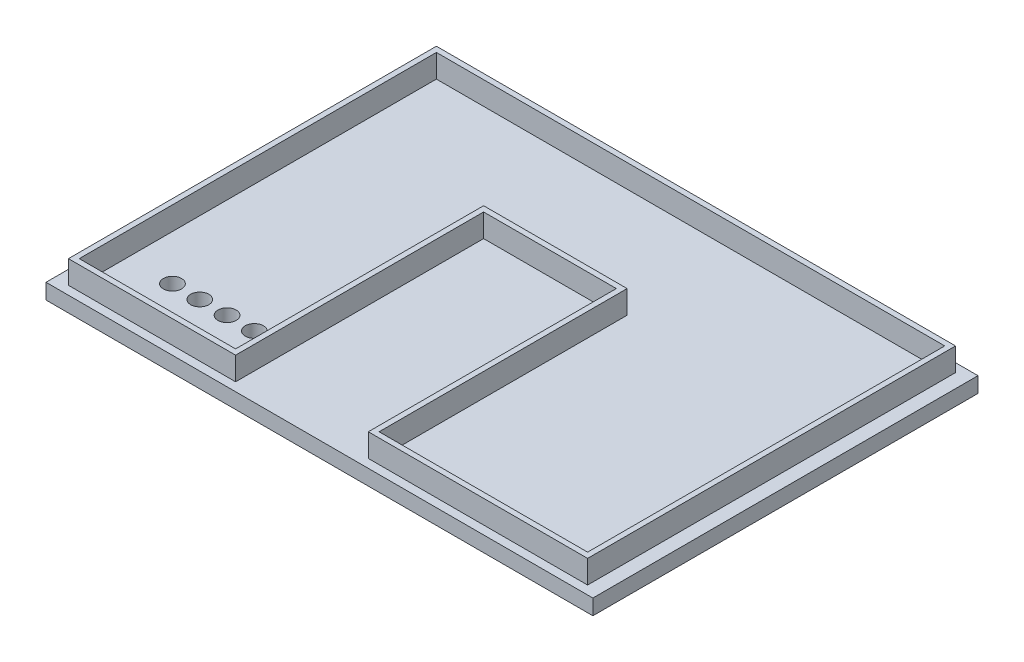
ISO-10303-21;
HEADER;
FILE_DESCRIPTION(('STEP AP214'),'2;1');
FILE_NAME('part.step','',(''),(''),'','','');
FILE_SCHEMA(('AUTOMOTIVE_DESIGN { 1 0 10303 214 1 1 1 1 }'));
ENDSEC;
DATA;
#1=APPLICATION_CONTEXT('core data for automotive mechanical design processes');
#2=APPLICATION_PROTOCOL_DEFINITION('international standard','automotive_design',2000,#1);
#3=PRODUCT_CONTEXT('',#1,'mechanical');
#4=PRODUCT('Part','Part','',(#3));
#5=PRODUCT_RELATED_PRODUCT_CATEGORY('part','',(#4));
#6=PRODUCT_DEFINITION_FORMATION('','',#4);
#7=PRODUCT_DEFINITION_CONTEXT('part definition',#1,'design');
#8=PRODUCT_DEFINITION('design','',#6,#7);
#9=PRODUCT_DEFINITION_SHAPE('','',#8);
#10=(LENGTH_UNIT() NAMED_UNIT(*) SI_UNIT(.MILLI.,.METRE.));
#11=(NAMED_UNIT(*) PLANE_ANGLE_UNIT() SI_UNIT($,.RADIAN.));
#12=(NAMED_UNIT(*) SI_UNIT($,.STERADIAN.) SOLID_ANGLE_UNIT());
#13=UNCERTAINTY_MEASURE_WITH_UNIT(LENGTH_MEASURE(1.E-05),#10,'distance_accuracy_value','');
#14=(GEOMETRIC_REPRESENTATION_CONTEXT(3) GLOBAL_UNCERTAINTY_ASSIGNED_CONTEXT((#13)) GLOBAL_UNIT_ASSIGNED_CONTEXT((#10,
#11,#12)) REPRESENTATION_CONTEXT('',''));
#15=CARTESIAN_POINT('',(0.,0.,0.));
#16=DIRECTION('',(0.,0.,1.));
#17=DIRECTION('',(1.,0.,0.));
#18=AXIS2_PLACEMENT_3D('',#15,#16,#17);
#19=CARTESIAN_POINT('',(0.,5.08,0.));
#20=DIRECTION('',(0.,1.,0.));
#21=DIRECTION('',(0.,0.,1.));
#22=AXIS2_PLACEMENT_3D('',#19,#20,#21);
#23=PLANE('',#22);
#24=DIRECTION('',(1.,0.,0.));
#25=VECTOR('',#24,1.);
#26=CARTESIAN_POINT('',(0.,5.08,0.));
#27=LINE('',#26,#25);
#28=CARTESIAN_POINT('',(0.,5.08,0.));
#29=VERTEX_POINT('',#28);
#30=CARTESIAN_POINT('',(180.34,5.08,0.));
#31=VERTEX_POINT('',#30);
#32=EDGE_CURVE('E353',#29,#31,#27,.T.);
#33=ORIENTED_EDGE('',*,*,#32,.T.);
#34=DIRECTION('',(0.,0.,-1.));
#35=VECTOR('',#34,1.);
#36=CARTESIAN_POINT('',(180.34,5.08,0.));
#37=LINE('',#36,#35);
#38=CARTESIAN_POINT('',(180.34,5.08,-127.));
#39=VERTEX_POINT('',#38);
#40=EDGE_CURVE('E356',#31,#39,#37,.T.);
#41=ORIENTED_EDGE('',*,*,#40,.T.);
#42=DIRECTION('',(1.,0.,0.));
#43=VECTOR('',#42,1.);
#44=CARTESIAN_POINT('',(0.,5.08,-127.));
#45=LINE('',#44,#43);
#46=CARTESIAN_POINT('',(0.,5.08,-127.));
#47=VERTEX_POINT('',#46);
#48=EDGE_CURVE('E359',#47,#39,#45,.T.);
#49=ORIENTED_EDGE('',*,*,#48,.F.);
#50=DIRECTION('',(0.,0.,-1.));
#51=VECTOR('',#50,1.);
#52=CARTESIAN_POINT('',(0.,5.08,0.));
#53=LINE('',#52,#51);
#54=EDGE_CURVE('E362',#29,#47,#53,.T.);
#55=ORIENTED_EDGE('',*,*,#54,.F.);
#56=EDGE_LOOP('',(#33,#41,#49,#55));
#57=FACE_BOUND('',#56,.T.);
#58=DIRECTION('',(-1.,0.,0.));
#59=VECTOR('',#58,1.);
#60=CARTESIAN_POINT('',(59.69,5.08,-2.8321));
#61=LINE('',#60,#59);
#62=CARTESIAN_POINT('',(59.69,5.08,-2.8321));
#63=VERTEX_POINT('',#62);
#64=CARTESIAN_POINT('',(4.57199999999998,5.08,-2.8321));
#65=VERTEX_POINT('',#64);
#66=EDGE_CURVE('E98',#63,#65,#61,.T.);
#67=ORIENTED_EDGE('',*,*,#66,.T.);
#68=DIRECTION('',(0.,0.,1.));
#69=VECTOR('',#68,1.);
#70=CARTESIAN_POINT('',(4.57199999999998,5.08,-124.1679));
#71=LINE('',#70,#69);
#72=CARTESIAN_POINT('',(4.57199999999998,5.08,-124.1679));
#73=VERTEX_POINT('',#72);
#74=EDGE_CURVE('E239',#73,#65,#71,.T.);
#75=ORIENTED_EDGE('',*,*,#74,.F.);
#76=DIRECTION('',(1.,0.,0.));
#77=VECTOR('',#76,1.);
#78=CARTESIAN_POINT('',(4.57199999999998,5.08,-124.1679));
#79=LINE('',#78,#77);
#80=CARTESIAN_POINT('',(175.768,5.08,-124.1679));
#81=VERTEX_POINT('',#80);
#82=EDGE_CURVE('E296',#73,#81,#79,.T.);
#83=ORIENTED_EDGE('',*,*,#82,.T.);
#84=DIRECTION('',(0.,0.,1.));
#85=VECTOR('',#84,1.);
#86=CARTESIAN_POINT('',(175.768,5.08,-124.1679));
#87=LINE('',#86,#85);
#88=CARTESIAN_POINT('',(175.768,5.08,-2.83210000000002));
#89=VERTEX_POINT('',#88);
#90=EDGE_CURVE('E328',#81,#89,#87,.T.);
#91=ORIENTED_EDGE('',*,*,#90,.T.);
#92=DIRECTION('',(1.,0.,0.));
#93=VECTOR('',#92,1.);
#94=CARTESIAN_POINT('',(103.4542,5.08,-2.83210000000002));
#95=LINE('',#94,#93);
#96=CARTESIAN_POINT('',(103.4542,5.08,-2.83210000000002));
#97=VERTEX_POINT('',#96);
#98=EDGE_CURVE('E325',#97,#89,#95,.T.);
#99=ORIENTED_EDGE('',*,*,#98,.F.);
#100=DIRECTION('',(0.,0.,1.));
#101=VECTOR('',#100,1.);
#102=CARTESIAN_POINT('',(103.4542,5.08,-84.6201));
#103=LINE('',#102,#101);
#104=CARTESIAN_POINT('',(103.4542,5.08,-84.6201));
#105=VERTEX_POINT('',#104);
#106=EDGE_CURVE('E322',#105,#97,#103,.T.);
#107=ORIENTED_EDGE('',*,*,#106,.F.);
#108=DIRECTION('',(1.,0.,0.));
#109=VECTOR('',#108,1.);
#110=CARTESIAN_POINT('',(59.69,5.08,-84.6201));
#111=LINE('',#110,#109);
#112=CARTESIAN_POINT('',(59.69,5.08,-84.6201));
#113=VERTEX_POINT('',#112);
#114=EDGE_CURVE('E319',#113,#105,#111,.T.);
#115=ORIENTED_EDGE('',*,*,#114,.F.);
#116=DIRECTION('',(0.,0.,1.));
#117=VECTOR('',#116,1.);
#118=CARTESIAN_POINT('',(59.69,5.08,-84.6201));
#119=LINE('',#118,#117);
#120=EDGE_CURVE('E103',#113,#63,#119,.T.);
#121=ORIENTED_EDGE('',*,*,#120,.T.);
#122=EDGE_LOOP('',(#67,#75,#83,#91,#99,#107,#115,#121));
#123=FACE_BOUND('',#122,.T.);
#124=ADVANCED_FACE('F81',(#57,#123),#23,.T.);
#125=CARTESIAN_POINT('',(0.,5.08,0.));
#126=DIRECTION('',(0.,0.,-1.));
#127=DIRECTION('',(-1.,0.,0.));
#128=AXIS2_PLACEMENT_3D('',#125,#126,#127);
#129=PLANE('',#128);
#130=DIRECTION('',(1.,0.,0.));
#131=VECTOR('',#130,1.);
#132=CARTESIAN_POINT('',(0.,0.,0.));
#133=LINE('',#132,#131);
#134=CARTESIAN_POINT('',(0.,0.,0.));
#135=VERTEX_POINT('',#134);
#136=CARTESIAN_POINT('',(180.34,0.,0.));
#137=VERTEX_POINT('',#136);
#138=EDGE_CURVE('E352',#135,#137,#133,.T.);
#139=ORIENTED_EDGE('',*,*,#138,.T.);
#140=DIRECTION('',(0.,-1.,0.));
#141=VECTOR('',#140,1.);
#142=CARTESIAN_POINT('',(180.34,5.08,0.));
#143=LINE('',#142,#141);
#144=EDGE_CURVE('E12',#31,#137,#143,.T.);
#145=ORIENTED_EDGE('',*,*,#144,.F.);
#146=ORIENTED_EDGE('',*,*,#32,.F.);
#147=DIRECTION('',(0.,-1.,0.));
#148=VECTOR('',#147,1.);
#149=CARTESIAN_POINT('',(0.,5.08,0.));
#150=LINE('',#149,#148);
#151=EDGE_CURVE('E365',#29,#135,#150,.T.);
#152=ORIENTED_EDGE('',*,*,#151,.T.);
#153=EDGE_LOOP('',(#139,#145,#146,#152));
#154=FACE_BOUND('',#153,.T.);
#155=ADVANCED_FACE('F83',(#154),#129,.F.);
#156=CARTESIAN_POINT('',(180.34,5.08,0.));
#157=DIRECTION('',(-1.,0.,0.));
#158=DIRECTION('',(0.,0.,1.));
#159=AXIS2_PLACEMENT_3D('',#156,#157,#158);
#160=PLANE('',#159);
#161=DIRECTION('',(0.,0.,-1.));
#162=VECTOR('',#161,1.);
#163=CARTESIAN_POINT('',(180.34,0.,0.));
#164=LINE('',#163,#162);
#165=CARTESIAN_POINT('',(180.34,0.,-127.));
#166=VERTEX_POINT('',#165);
#167=EDGE_CURVE('E368',#137,#166,#164,.T.);
#168=ORIENTED_EDGE('',*,*,#167,.T.);
#169=DIRECTION('',(0.,-1.,0.));
#170=VECTOR('',#169,1.);
#171=CARTESIAN_POINT('',(180.34,5.08,-127.));
#172=LINE('',#171,#170);
#173=EDGE_CURVE('E90',#39,#166,#172,.T.);
#174=ORIENTED_EDGE('',*,*,#173,.F.);
#175=ORIENTED_EDGE('',*,*,#40,.F.);
#176=ORIENTED_EDGE('',*,*,#144,.T.);
#177=EDGE_LOOP('',(#168,#174,#175,#176));
#178=FACE_BOUND('',#177,.T.);
#179=ADVANCED_FACE('F431',(#178),#160,.F.);
#180=CARTESIAN_POINT('',(0.,5.08,-127.));
#181=DIRECTION('',(0.,0.,-1.));
#182=DIRECTION('',(-1.,0.,0.));
#183=AXIS2_PLACEMENT_3D('',#180,#181,#182);
#184=PLANE('',#183);
#185=DIRECTION('',(1.,0.,0.));
#186=VECTOR('',#185,1.);
#187=CARTESIAN_POINT('',(0.,0.,-127.));
#188=LINE('',#187,#186);
#189=CARTESIAN_POINT('',(0.,0.,-127.));
#190=VERTEX_POINT('',#189);
#191=EDGE_CURVE('E371',#190,#166,#188,.T.);
#192=ORIENTED_EDGE('',*,*,#191,.F.);
#193=DIRECTION('',(0.,-1.,0.));
#194=VECTOR('',#193,1.);
#195=CARTESIAN_POINT('',(0.,5.08,-127.));
#196=LINE('',#195,#194);
#197=EDGE_CURVE('E377',#47,#190,#196,.T.);
#198=ORIENTED_EDGE('',*,*,#197,.F.);
#199=ORIENTED_EDGE('',*,*,#48,.T.);
#200=ORIENTED_EDGE('',*,*,#173,.T.);
#201=EDGE_LOOP('',(#192,#198,#199,#200));
#202=FACE_BOUND('',#201,.T.);
#203=ADVANCED_FACE('F428',(#202),#184,.T.);
#204=CARTESIAN_POINT('',(0.,5.08,0.));
#205=DIRECTION('',(-1.,0.,0.));
#206=DIRECTION('',(0.,0.,1.));
#207=AXIS2_PLACEMENT_3D('',#204,#205,#206);
#208=PLANE('',#207);
#209=DIRECTION('',(0.,0.,-1.));
#210=VECTOR('',#209,1.);
#211=CARTESIAN_POINT('',(0.,0.,0.));
#212=LINE('',#211,#210);
#213=EDGE_CURVE('E357',#135,#190,#212,.T.);
#214=ORIENTED_EDGE('',*,*,#213,.F.);
#215=ORIENTED_EDGE('',*,*,#151,.F.);
#216=ORIENTED_EDGE('',*,*,#54,.T.);
#217=ORIENTED_EDGE('',*,*,#197,.T.);
#218=EDGE_LOOP('',(#214,#215,#216,#217));
#219=FACE_BOUND('',#218,.T.);
#220=ADVANCED_FACE('F411',(#219),#208,.T.);
#221=CARTESIAN_POINT('',(0.,0.,0.));
#222=DIRECTION('',(0.,1.,0.));
#223=DIRECTION('',(0.,0.,1.));
#224=AXIS2_PLACEMENT_3D('',#221,#222,#223);
#225=PLANE('',#224);
#226=CARTESIAN_POINT('',(30.26,0.,-20.4409059762369));
#227=DIRECTION('',(0.,-1.,0.));
#228=DIRECTION('',(0.,0.,-1.));
#229=AXIS2_PLACEMENT_3D('',#226,#227,#228);
#230=CIRCLE('',#229,3.);
#231=CARTESIAN_POINT('',(30.26,0.,-23.4409059762369));
#232=VERTEX_POINT('',#231);
#233=EDGE_CURVE('E386',#232,#232,#230,.T.);
#234=ORIENTED_EDGE('',*,*,#233,.F.);
#235=EDGE_LOOP('',(#234));
#236=FACE_BOUND('',#235,.T.);
#237=CARTESIAN_POINT('',(39.26,0.,-20.4409059762369));
#238=DIRECTION('',(0.,-1.,0.));
#239=DIRECTION('',(0.,0.,-1.));
#240=AXIS2_PLACEMENT_3D('',#237,#238,#239);
#241=CIRCLE('',#240,3.);
#242=CARTESIAN_POINT('',(39.26,0.,-23.4409059762369));
#243=VERTEX_POINT('',#242);
#244=EDGE_CURVE('E400',#243,#243,#241,.T.);
#245=ORIENTED_EDGE('',*,*,#244,.F.);
#246=EDGE_LOOP('',(#245));
#247=FACE_BOUND('',#246,.T.);
#248=CARTESIAN_POINT('',(48.26,0.,-20.4409059762369));
#249=DIRECTION('',(0.,-1.,0.));
#250=DIRECTION('',(0.,0.,-1.));
#251=AXIS2_PLACEMENT_3D('',#248,#249,#250);
#252=CIRCLE('',#251,3.);
#253=CARTESIAN_POINT('',(48.26,0.,-23.4409059762369));
#254=VERTEX_POINT('',#253);
#255=EDGE_CURVE('E397',#254,#254,#252,.T.);
#256=ORIENTED_EDGE('',*,*,#255,.F.);
#257=EDGE_LOOP('',(#256));
#258=FACE_BOUND('',#257,.T.);
#259=CARTESIAN_POINT('',(21.26,0.,-20.4409059762369));
#260=DIRECTION('',(0.,-1.,0.));
#261=DIRECTION('',(0.,0.,-1.));
#262=AXIS2_PLACEMENT_3D('',#259,#260,#261);
#263=CIRCLE('',#262,3.);
#264=CARTESIAN_POINT('',(21.26,0.,-23.4409059762369));
#265=VERTEX_POINT('',#264);
#266=EDGE_CURVE('E382',#265,#265,#263,.T.);
#267=ORIENTED_EDGE('',*,*,#266,.F.);
#268=EDGE_LOOP('',(#267));
#269=FACE_BOUND('',#268,.T.);
#270=ORIENTED_EDGE('',*,*,#138,.F.);
#271=ORIENTED_EDGE('',*,*,#213,.T.);
#272=ORIENTED_EDGE('',*,*,#191,.T.);
#273=ORIENTED_EDGE('',*,*,#167,.F.);
#274=EDGE_LOOP('',(#270,#271,#272,#273));
#275=FACE_BOUND('',#274,.T.);
#276=ADVANCED_FACE('F408',(#236,#247,#258,#269,#275),#225,.F.);
#277=CARTESIAN_POINT('',(0.,12.7,0.));
#278=DIRECTION('',(0.,-1.,0.));
#279=DIRECTION('',(0.,0.,-1.));
#280=AXIS2_PLACEMENT_3D('',#277,#278,#279);
#281=PLANE('',#280);
#282=DIRECTION('',(0.,0.,1.));
#283=VECTOR('',#282,1.);
#284=CARTESIAN_POINT('',(4.57199999999998,12.7,-124.1679));
#285=LINE('',#284,#283);
#286=CARTESIAN_POINT('',(4.57199999999998,12.7,-124.1679));
#287=VERTEX_POINT('',#286);
#288=CARTESIAN_POINT('',(4.57199999999998,12.7,-2.8321));
#289=VERTEX_POINT('',#288);
#290=EDGE_CURVE('E293',#287,#289,#285,.T.);
#291=ORIENTED_EDGE('',*,*,#290,.T.);
#292=DIRECTION('',(-1.,0.,0.));
#293=VECTOR('',#292,1.);
#294=CARTESIAN_POINT('',(59.69,12.7,-2.8321));
#295=LINE('',#294,#293);
#296=CARTESIAN_POINT('',(59.69,12.7,-2.8321));
#297=VERTEX_POINT('',#296);
#298=EDGE_CURVE('E295',#297,#289,#295,.T.);
#299=ORIENTED_EDGE('',*,*,#298,.F.);
#300=DIRECTION('',(0.,0.,1.));
#301=VECTOR('',#300,1.);
#302=CARTESIAN_POINT('',(59.69,12.7,-84.6201));
#303=LINE('',#302,#301);
#304=CARTESIAN_POINT('',(59.69,12.7,-84.6201));
#305=VERTEX_POINT('',#304);
#306=EDGE_CURVE('E299',#305,#297,#303,.T.);
#307=ORIENTED_EDGE('',*,*,#306,.F.);
#308=DIRECTION('',(1.,0.,0.));
#309=VECTOR('',#308,1.);
#310=CARTESIAN_POINT('',(59.69,12.7,-84.6201));
#311=LINE('',#310,#309);
#312=CARTESIAN_POINT('',(103.4542,12.7,-84.6201));
#313=VERTEX_POINT('',#312);
#314=EDGE_CURVE('E302',#305,#313,#311,.T.);
#315=ORIENTED_EDGE('',*,*,#314,.T.);
#316=DIRECTION('',(0.,0.,1.));
#317=VECTOR('',#316,1.);
#318=CARTESIAN_POINT('',(103.4542,12.7,-84.6201));
#319=LINE('',#318,#317);
#320=CARTESIAN_POINT('',(103.4542,12.7,-2.83210000000002));
#321=VERTEX_POINT('',#320);
#322=EDGE_CURVE('E304',#313,#321,#319,.T.);
#323=ORIENTED_EDGE('',*,*,#322,.T.);
#324=DIRECTION('',(1.,0.,0.));
#325=VECTOR('',#324,1.);
#326=CARTESIAN_POINT('',(103.4542,12.7,-2.83210000000002));
#327=LINE('',#326,#325);
#328=CARTESIAN_POINT('',(175.768,12.7,-2.83210000000002));
#329=VERTEX_POINT('',#328);
#330=EDGE_CURVE('E306',#321,#329,#327,.T.);
#331=ORIENTED_EDGE('',*,*,#330,.T.);
#332=DIRECTION('',(0.,0.,1.));
#333=VECTOR('',#332,1.);
#334=CARTESIAN_POINT('',(175.768,12.7,-124.1679));
#335=LINE('',#334,#333);
#336=CARTESIAN_POINT('',(175.768,12.7,-124.1679));
#337=VERTEX_POINT('',#336);
#338=EDGE_CURVE('E308',#337,#329,#335,.T.);
#339=ORIENTED_EDGE('',*,*,#338,.F.);
#340=DIRECTION('',(1.,0.,0.));
#341=VECTOR('',#340,1.);
#342=CARTESIAN_POINT('',(4.57199999999998,12.7,-124.1679));
#343=LINE('',#342,#341);
#344=EDGE_CURVE('E311',#287,#337,#343,.T.);
#345=ORIENTED_EDGE('',*,*,#344,.F.);
#346=EDGE_LOOP('',(#291,#299,#307,#315,#323,#331,#339,#345));
#347=FACE_BOUND('',#346,.T.);
#348=DIRECTION('',(-1.,0.,0.));
#349=VECTOR('',#348,1.);
#350=CARTESIAN_POINT('',(173.99,12.7,-122.3899));
#351=LINE('',#350,#349);
#352=CARTESIAN_POINT('',(173.99,12.7,-122.3899));
#353=VERTEX_POINT('',#352);
#354=CARTESIAN_POINT('',(6.34999999999997,12.7,-122.3899));
#355=VERTEX_POINT('',#354);
#356=EDGE_CURVE('E220',#353,#355,#351,.T.);
#357=ORIENTED_EDGE('',*,*,#356,.F.);
#358=DIRECTION('',(0.,0.,-1.));
#359=VECTOR('',#358,1.);
#360=CARTESIAN_POINT('',(173.99,12.7,-4.61010000000002));
#361=LINE('',#360,#359);
#362=CARTESIAN_POINT('',(173.99,12.7,-4.61010000000002));
#363=VERTEX_POINT('',#362);
#364=EDGE_CURVE('E259',#363,#353,#361,.T.);
#365=ORIENTED_EDGE('',*,*,#364,.F.);
#366=DIRECTION('',(1.,0.,0.));
#367=VECTOR('',#366,1.);
#368=CARTESIAN_POINT('',(105.2322,12.7,-4.61010000000002));
#369=LINE('',#368,#367);
#370=CARTESIAN_POINT('',(105.2322,12.7,-4.61010000000002));
#371=VERTEX_POINT('',#370);
#372=EDGE_CURVE('E256',#371,#363,#369,.T.);
#373=ORIENTED_EDGE('',*,*,#372,.F.);
#374=DIRECTION('',(0.,0.,1.));
#375=VECTOR('',#374,1.);
#376=CARTESIAN_POINT('',(105.2322,12.7,-86.3981));
#377=LINE('',#376,#375);
#378=CARTESIAN_POINT('',(105.2322,12.7,-86.3981));
#379=VERTEX_POINT('',#378);
#380=EDGE_CURVE('E254',#379,#371,#377,.T.);
#381=ORIENTED_EDGE('',*,*,#380,.F.);
#382=DIRECTION('',(1.,0.,0.));
#383=VECTOR('',#382,1.);
#384=CARTESIAN_POINT('',(57.912,12.7,-86.3981));
#385=LINE('',#384,#383);
#386=CARTESIAN_POINT('',(57.912,12.7,-86.3981));
#387=VERTEX_POINT('',#386);
#388=EDGE_CURVE('E252',#387,#379,#385,.T.);
#389=ORIENTED_EDGE('',*,*,#388,.F.);
#390=DIRECTION('',(0.,0.,-1.));
#391=VECTOR('',#390,1.);
#392=CARTESIAN_POINT('',(57.912,12.7,-4.6101));
#393=LINE('',#392,#391);
#394=CARTESIAN_POINT('',(57.912,12.7,-4.6101));
#395=VERTEX_POINT('',#394);
#396=EDGE_CURVE('E247',#395,#387,#393,.T.);
#397=ORIENTED_EDGE('',*,*,#396,.F.);
#398=DIRECTION('',(1.,0.,0.));
#399=VECTOR('',#398,1.);
#400=CARTESIAN_POINT('',(6.34999999999998,12.7,-4.6101));
#401=LINE('',#400,#399);
#402=CARTESIAN_POINT('',(6.34999999999998,12.7,-4.6101));
#403=VERTEX_POINT('',#402);
#404=EDGE_CURVE('E245',#403,#395,#401,.T.);
#405=ORIENTED_EDGE('',*,*,#404,.F.);
#406=DIRECTION('',(0.,0.,1.));
#407=VECTOR('',#406,1.);
#408=CARTESIAN_POINT('',(6.34999999999997,12.7,-122.3899));
#409=LINE('',#408,#407);
#410=EDGE_CURVE('E230',#355,#403,#409,.T.);
#411=ORIENTED_EDGE('',*,*,#410,.F.);
#412=EDGE_LOOP('',(#357,#365,#373,#381,#389,#397,#405,#411));
#413=FACE_BOUND('',#412,.T.);
#414=ADVANCED_FACE('F243',(#347,#413),#281,.F.);
#415=CARTESIAN_POINT('',(4.57199999999998,12.7,-124.1679));
#416=DIRECTION('',(1.,0.,0.));
#417=DIRECTION('',(0.,0.,-1.));
#418=AXIS2_PLACEMENT_3D('',#415,#416,#417);
#419=PLANE('',#418);
#420=ORIENTED_EDGE('',*,*,#74,.T.);
#421=DIRECTION('',(0.,-1.,0.));
#422=VECTOR('',#421,1.);
#423=CARTESIAN_POINT('',(4.57199999999998,12.7,-2.8321));
#424=LINE('',#423,#422);
#425=EDGE_CURVE('E350',#289,#65,#424,.T.);
#426=ORIENTED_EDGE('',*,*,#425,.F.);
#427=ORIENTED_EDGE('',*,*,#290,.F.);
#428=DIRECTION('',(0.,-1.,0.));
#429=VECTOR('',#428,1.);
#430=CARTESIAN_POINT('',(4.57199999999998,12.7,-124.1679));
#431=LINE('',#430,#429);
#432=EDGE_CURVE('E314',#287,#73,#431,.T.);
#433=ORIENTED_EDGE('',*,*,#432,.T.);
#434=EDGE_LOOP('',(#420,#426,#427,#433));
#435=FACE_BOUND('',#434,.T.);
#436=ADVANCED_FACE('F497',(#435),#419,.F.);
#437=CARTESIAN_POINT('',(59.69,12.7,-2.8321));
#438=DIRECTION('',(0.,0.,1.));
#439=DIRECTION('',(1.,0.,0.));
#440=AXIS2_PLACEMENT_3D('',#437,#438,#439);
#441=PLANE('',#440);
#442=ORIENTED_EDGE('',*,*,#66,.F.);
#443=DIRECTION('',(0.,-1.,0.));
#444=VECTOR('',#443,1.);
#445=CARTESIAN_POINT('',(59.69,12.7,-2.8321));
#446=LINE('',#445,#444);
#447=EDGE_CURVE('E348',#297,#63,#446,.T.);
#448=ORIENTED_EDGE('',*,*,#447,.F.);
#449=ORIENTED_EDGE('',*,*,#298,.T.);
#450=ORIENTED_EDGE('',*,*,#425,.T.);
#451=EDGE_LOOP('',(#442,#448,#449,#450));
#452=FACE_BOUND('',#451,.T.);
#453=ADVANCED_FACE('F521',(#452),#441,.T.);
#454=CARTESIAN_POINT('',(59.69,12.7,-84.6201));
#455=DIRECTION('',(1.,0.,0.));
#456=DIRECTION('',(0.,0.,-1.));
#457=AXIS2_PLACEMENT_3D('',#454,#455,#456);
#458=PLANE('',#457);
#459=ORIENTED_EDGE('',*,*,#120,.F.);
#460=DIRECTION('',(0.,-1.,0.));
#461=VECTOR('',#460,1.);
#462=CARTESIAN_POINT('',(59.69,12.7,-84.6201));
#463=LINE('',#462,#461);
#464=EDGE_CURVE('E345',#305,#113,#463,.T.);
#465=ORIENTED_EDGE('',*,*,#464,.F.);
#466=ORIENTED_EDGE('',*,*,#306,.T.);
#467=ORIENTED_EDGE('',*,*,#447,.T.);
#468=EDGE_LOOP('',(#459,#465,#466,#467));
#469=FACE_BOUND('',#468,.T.);
#470=ADVANCED_FACE('F517',(#469),#458,.T.);
#471=CARTESIAN_POINT('',(59.69,12.7,-84.6201));
#472=DIRECTION('',(0.,0.,-1.));
#473=DIRECTION('',(-1.,0.,0.));
#474=AXIS2_PLACEMENT_3D('',#471,#472,#473);
#475=PLANE('',#474);
#476=ORIENTED_EDGE('',*,*,#114,.T.);
#477=DIRECTION('',(0.,-1.,0.));
#478=VECTOR('',#477,1.);
#479=CARTESIAN_POINT('',(103.4542,12.7,-84.6201));
#480=LINE('',#479,#478);
#481=EDGE_CURVE('E342',#313,#105,#480,.T.);
#482=ORIENTED_EDGE('',*,*,#481,.F.);
#483=ORIENTED_EDGE('',*,*,#314,.F.);
#484=ORIENTED_EDGE('',*,*,#464,.T.);
#485=EDGE_LOOP('',(#476,#482,#483,#484));
#486=FACE_BOUND('',#485,.T.);
#487=ADVANCED_FACE('F513',(#486),#475,.F.);
#488=CARTESIAN_POINT('',(103.4542,12.7,-84.6201));
#489=DIRECTION('',(1.,0.,0.));
#490=DIRECTION('',(0.,0.,-1.));
#491=AXIS2_PLACEMENT_3D('',#488,#489,#490);
#492=PLANE('',#491);
#493=ORIENTED_EDGE('',*,*,#106,.T.);
#494=DIRECTION('',(0.,-1.,0.));
#495=VECTOR('',#494,1.);
#496=CARTESIAN_POINT('',(103.4542,12.7,-2.83210000000002));
#497=LINE('',#496,#495);
#498=EDGE_CURVE('E339',#321,#97,#497,.T.);
#499=ORIENTED_EDGE('',*,*,#498,.F.);
#500=ORIENTED_EDGE('',*,*,#322,.F.);
#501=ORIENTED_EDGE('',*,*,#481,.T.);
#502=EDGE_LOOP('',(#493,#499,#500,#501));
#503=FACE_BOUND('',#502,.T.);
#504=ADVANCED_FACE('F509',(#503),#492,.F.);
#505=CARTESIAN_POINT('',(103.4542,12.7,-2.83210000000002));
#506=DIRECTION('',(0.,0.,-1.));
#507=DIRECTION('',(-1.,0.,0.));
#508=AXIS2_PLACEMENT_3D('',#505,#506,#507);
#509=PLANE('',#508);
#510=ORIENTED_EDGE('',*,*,#98,.T.);
#511=DIRECTION('',(0.,-1.,0.));
#512=VECTOR('',#511,1.);
#513=CARTESIAN_POINT('',(175.768,12.7,-2.83210000000002));
#514=LINE('',#513,#512);
#515=EDGE_CURVE('E336',#329,#89,#514,.T.);
#516=ORIENTED_EDGE('',*,*,#515,.F.);
#517=ORIENTED_EDGE('',*,*,#330,.F.);
#518=ORIENTED_EDGE('',*,*,#498,.T.);
#519=EDGE_LOOP('',(#510,#516,#517,#518));
#520=FACE_BOUND('',#519,.T.);
#521=ADVANCED_FACE('F505',(#520),#509,.F.);
#522=CARTESIAN_POINT('',(175.768,12.7,-124.1679));
#523=DIRECTION('',(1.,0.,0.));
#524=DIRECTION('',(0.,0.,-1.));
#525=AXIS2_PLACEMENT_3D('',#522,#523,#524);
#526=PLANE('',#525);
#527=ORIENTED_EDGE('',*,*,#90,.F.);
#528=DIRECTION('',(0.,-1.,0.));
#529=VECTOR('',#528,1.);
#530=CARTESIAN_POINT('',(175.768,12.7,-124.1679));
#531=LINE('',#530,#529);
#532=EDGE_CURVE('E333',#337,#81,#531,.T.);
#533=ORIENTED_EDGE('',*,*,#532,.F.);
#534=ORIENTED_EDGE('',*,*,#338,.T.);
#535=ORIENTED_EDGE('',*,*,#515,.T.);
#536=EDGE_LOOP('',(#527,#533,#534,#535));
#537=FACE_BOUND('',#536,.T.);
#538=ADVANCED_FACE('F501',(#537),#526,.T.);
#539=CARTESIAN_POINT('',(4.57199999999998,12.7,-124.1679));
#540=DIRECTION('',(0.,0.,-1.));
#541=DIRECTION('',(-1.,0.,0.));
#542=AXIS2_PLACEMENT_3D('',#539,#540,#541);
#543=PLANE('',#542);
#544=ORIENTED_EDGE('',*,*,#82,.F.);
#545=ORIENTED_EDGE('',*,*,#432,.F.);
#546=ORIENTED_EDGE('',*,*,#344,.T.);
#547=ORIENTED_EDGE('',*,*,#532,.T.);
#548=EDGE_LOOP('',(#544,#545,#546,#547));
#549=FACE_BOUND('',#548,.T.);
#550=ADVANCED_FACE('F494',(#549),#543,.T.);
#551=CARTESIAN_POINT('',(173.99,12.7,-122.3899));
#552=DIRECTION('',(0.,0.,1.));
#553=DIRECTION('',(1.,0.,0.));
#554=AXIS2_PLACEMENT_3D('',#551,#552,#553);
#555=PLANE('',#554);
#556=DIRECTION('',(-1.,0.,0.));
#557=VECTOR('',#556,1.);
#558=CARTESIAN_POINT('',(173.99,5.08,-122.3899));
#559=LINE('',#558,#557);
#560=CARTESIAN_POINT('',(173.99,5.08,-122.3899));
#561=VERTEX_POINT('',#560);
#562=CARTESIAN_POINT('',(6.34999999999997,5.08,-122.3899));
#563=VERTEX_POINT('',#562);
#564=EDGE_CURVE('E261',#561,#563,#559,.T.);
#565=ORIENTED_EDGE('',*,*,#564,.F.);
#566=DIRECTION('',(0.,-1.,0.));
#567=VECTOR('',#566,1.);
#568=CARTESIAN_POINT('',(173.99,12.7,-122.3899));
#569=LINE('',#568,#567);
#570=EDGE_CURVE('E226',#353,#561,#569,.T.);
#571=ORIENTED_EDGE('',*,*,#570,.F.);
#572=ORIENTED_EDGE('',*,*,#356,.T.);
#573=DIRECTION('',(0.,-1.,0.));
#574=VECTOR('',#573,1.);
#575=CARTESIAN_POINT('',(6.34999999999997,12.7,-122.3899));
#576=LINE('',#575,#574);
#577=EDGE_CURVE('E224',#355,#563,#576,.T.);
#578=ORIENTED_EDGE('',*,*,#577,.T.);
#579=EDGE_LOOP('',(#565,#571,#572,#578));
#580=FACE_BOUND('',#579,.T.);
#581=ADVANCED_FACE('F223',(#580),#555,.T.);
#582=CARTESIAN_POINT('',(6.34999999999997,12.7,-122.3899));
#583=DIRECTION('',(1.,0.,0.));
#584=DIRECTION('',(0.,0.,-1.));
#585=AXIS2_PLACEMENT_3D('',#582,#583,#584);
#586=PLANE('',#585);
#587=DIRECTION('',(0.,0.,1.));
#588=VECTOR('',#587,1.);
#589=CARTESIAN_POINT('',(6.34999999999997,5.08,-122.3899));
#590=LINE('',#589,#588);
#591=CARTESIAN_POINT('',(6.34999999999998,5.08,-4.6101));
#592=VERTEX_POINT('',#591);
#593=EDGE_CURVE('E238',#563,#592,#590,.T.);
#594=ORIENTED_EDGE('',*,*,#593,.F.);
#595=ORIENTED_EDGE('',*,*,#577,.F.);
#596=ORIENTED_EDGE('',*,*,#410,.T.);
#597=DIRECTION('',(0.,-1.,0.));
#598=VECTOR('',#597,1.);
#599=CARTESIAN_POINT('',(6.34999999999998,12.7,-4.6101));
#600=LINE('',#599,#598);
#601=EDGE_CURVE('E240',#403,#592,#600,.T.);
#602=ORIENTED_EDGE('',*,*,#601,.T.);
#603=EDGE_LOOP('',(#594,#595,#596,#602));
#604=FACE_BOUND('',#603,.T.);
#605=ADVANCED_FACE('F235',(#604),#586,.T.);
#606=CARTESIAN_POINT('',(6.34999999999998,12.7,-4.6101));
#607=DIRECTION('',(0.,0.,-1.));
#608=DIRECTION('',(-1.,0.,0.));
#609=AXIS2_PLACEMENT_3D('',#606,#607,#608);
#610=PLANE('',#609);
#611=DIRECTION('',(1.,0.,0.));
#612=VECTOR('',#611,1.);
#613=CARTESIAN_POINT('',(6.34999999999998,5.08,-4.6101));
#614=LINE('',#613,#612);
#615=CARTESIAN_POINT('',(57.912,5.08,-4.6101));
#616=VERTEX_POINT('',#615);
#617=EDGE_CURVE('E265',#592,#616,#614,.T.);
#618=ORIENTED_EDGE('',*,*,#617,.F.);
#619=ORIENTED_EDGE('',*,*,#601,.F.);
#620=ORIENTED_EDGE('',*,*,#404,.T.);
#621=DIRECTION('',(0.,-1.,0.));
#622=VECTOR('',#621,1.);
#623=CARTESIAN_POINT('',(57.912,12.7,-4.6101));
#624=LINE('',#623,#622);
#625=EDGE_CURVE('E289',#395,#616,#624,.T.);
#626=ORIENTED_EDGE('',*,*,#625,.T.);
#627=EDGE_LOOP('',(#618,#619,#620,#626));
#628=FACE_BOUND('',#627,.T.);
#629=ADVANCED_FACE('F481',(#628),#610,.T.);
#630=CARTESIAN_POINT('',(57.912,12.7,-4.6101));
#631=DIRECTION('',(-1.,0.,0.));
#632=DIRECTION('',(0.,0.,1.));
#633=AXIS2_PLACEMENT_3D('',#630,#631,#632);
#634=PLANE('',#633);
#635=DIRECTION('',(0.,0.,-1.));
#636=VECTOR('',#635,1.);
#637=CARTESIAN_POINT('',(57.912,5.08,-4.6101));
#638=LINE('',#637,#636);
#639=CARTESIAN_POINT('',(57.912,5.08,-86.3981));
#640=VERTEX_POINT('',#639);
#641=EDGE_CURVE('E267',#616,#640,#638,.T.);
#642=ORIENTED_EDGE('',*,*,#641,.F.);
#643=ORIENTED_EDGE('',*,*,#625,.F.);
#644=ORIENTED_EDGE('',*,*,#396,.T.);
#645=DIRECTION('',(0.,-1.,0.));
#646=VECTOR('',#645,1.);
#647=CARTESIAN_POINT('',(57.912,12.7,-86.3981));
#648=LINE('',#647,#646);
#649=EDGE_CURVE('E286',#387,#640,#648,.T.);
#650=ORIENTED_EDGE('',*,*,#649,.T.);
#651=EDGE_LOOP('',(#642,#643,#644,#650));
#652=FACE_BOUND('',#651,.T.);
#653=ADVANCED_FACE('F478',(#652),#634,.T.);
#654=CARTESIAN_POINT('',(57.912,12.7,-86.3981));
#655=DIRECTION('',(0.,0.,-1.));
#656=DIRECTION('',(-1.,0.,0.));
#657=AXIS2_PLACEMENT_3D('',#654,#655,#656);
#658=PLANE('',#657);
#659=DIRECTION('',(1.,0.,0.));
#660=VECTOR('',#659,1.);
#661=CARTESIAN_POINT('',(57.912,5.08,-86.3981));
#662=LINE('',#661,#660);
#663=CARTESIAN_POINT('',(105.2322,5.08,-86.3981));
#664=VERTEX_POINT('',#663);
#665=EDGE_CURVE('E269',#640,#664,#662,.T.);
#666=ORIENTED_EDGE('',*,*,#665,.F.);
#667=ORIENTED_EDGE('',*,*,#649,.F.);
#668=ORIENTED_EDGE('',*,*,#388,.T.);
#669=DIRECTION('',(0.,-1.,0.));
#670=VECTOR('',#669,1.);
#671=CARTESIAN_POINT('',(105.2322,12.7,-86.3981));
#672=LINE('',#671,#670);
#673=EDGE_CURVE('E283',#379,#664,#672,.T.);
#674=ORIENTED_EDGE('',*,*,#673,.T.);
#675=EDGE_LOOP('',(#666,#667,#668,#674));
#676=FACE_BOUND('',#675,.T.);
#677=ADVANCED_FACE('F473',(#676),#658,.T.);
#678=CARTESIAN_POINT('',(105.2322,12.7,-86.3981));
#679=DIRECTION('',(1.,0.,0.));
#680=DIRECTION('',(0.,0.,-1.));
#681=AXIS2_PLACEMENT_3D('',#678,#679,#680);
#682=PLANE('',#681);
#683=DIRECTION('',(0.,0.,1.));
#684=VECTOR('',#683,1.);
#685=CARTESIAN_POINT('',(105.2322,5.08,-86.3981));
#686=LINE('',#685,#684);
#687=CARTESIAN_POINT('',(105.2322,5.08,-4.61010000000002));
#688=VERTEX_POINT('',#687);
#689=EDGE_CURVE('E271',#664,#688,#686,.T.);
#690=ORIENTED_EDGE('',*,*,#689,.F.);
#691=ORIENTED_EDGE('',*,*,#673,.F.);
#692=ORIENTED_EDGE('',*,*,#380,.T.);
#693=DIRECTION('',(0.,-1.,0.));
#694=VECTOR('',#693,1.);
#695=CARTESIAN_POINT('',(105.2322,12.7,-4.61010000000002));
#696=LINE('',#695,#694);
#697=EDGE_CURVE('E280',#371,#688,#696,.T.);
#698=ORIENTED_EDGE('',*,*,#697,.T.);
#699=EDGE_LOOP('',(#690,#691,#692,#698));
#700=FACE_BOUND('',#699,.T.);
#701=ADVANCED_FACE('F469',(#700),#682,.T.);
#702=CARTESIAN_POINT('',(105.2322,12.7,-4.61010000000002));
#703=DIRECTION('',(0.,0.,-1.));
#704=DIRECTION('',(-1.,0.,0.));
#705=AXIS2_PLACEMENT_3D('',#702,#703,#704);
#706=PLANE('',#705);
#707=DIRECTION('',(1.,0.,0.));
#708=VECTOR('',#707,1.);
#709=CARTESIAN_POINT('',(105.2322,5.08,-4.61010000000002));
#710=LINE('',#709,#708);
#711=CARTESIAN_POINT('',(173.99,5.08,-4.61010000000002));
#712=VERTEX_POINT('',#711);
#713=EDGE_CURVE('E273',#688,#712,#710,.T.);
#714=ORIENTED_EDGE('',*,*,#713,.F.);
#715=ORIENTED_EDGE('',*,*,#697,.F.);
#716=ORIENTED_EDGE('',*,*,#372,.T.);
#717=DIRECTION('',(0.,-1.,0.));
#718=VECTOR('',#717,1.);
#719=CARTESIAN_POINT('',(173.99,12.7,-4.61010000000002));
#720=LINE('',#719,#718);
#721=EDGE_CURVE('E277',#363,#712,#720,.T.);
#722=ORIENTED_EDGE('',*,*,#721,.T.);
#723=EDGE_LOOP('',(#714,#715,#716,#722));
#724=FACE_BOUND('',#723,.T.);
#725=ADVANCED_FACE('F451',(#724),#706,.T.);
#726=CARTESIAN_POINT('',(173.99,12.7,-4.61010000000002));
#727=DIRECTION('',(-1.,0.,0.));
#728=DIRECTION('',(0.,0.,1.));
#729=AXIS2_PLACEMENT_3D('',#726,#727,#728);
#730=PLANE('',#729);
#731=DIRECTION('',(0.,0.,-1.));
#732=VECTOR('',#731,1.);
#733=CARTESIAN_POINT('',(173.99,5.08,-4.61010000000002));
#734=LINE('',#733,#732);
#735=EDGE_CURVE('E231',#712,#561,#734,.T.);
#736=ORIENTED_EDGE('',*,*,#735,.F.);
#737=ORIENTED_EDGE('',*,*,#721,.F.);
#738=ORIENTED_EDGE('',*,*,#364,.T.);
#739=ORIENTED_EDGE('',*,*,#570,.T.);
#740=EDGE_LOOP('',(#736,#737,#738,#739));
#741=FACE_BOUND('',#740,.T.);
#742=ADVANCED_FACE('F442',(#741),#730,.T.);
#743=CARTESIAN_POINT('',(30.26,5.08,-20.4409059762369));
#744=DIRECTION('',(0.,1.,0.));
#745=DIRECTION('',(0.,0.,1.));
#746=AXIS2_PLACEMENT_3D('',#743,#744,#745);
#747=CIRCLE('',#746,3.);
#748=CARTESIAN_POINT('',(30.26,5.08,-17.4409059762369));
#749=VERTEX_POINT('',#748);
#750=EDGE_CURVE('E85',#749,#749,#747,.T.);
#751=ORIENTED_EDGE('',*,*,#750,.F.);
#752=EDGE_LOOP('',(#751));
#753=FACE_BOUND('',#752,.T.);
#754=CARTESIAN_POINT('',(39.26,5.08,-20.4409059762369));
#755=DIRECTION('',(0.,1.,0.));
#756=DIRECTION('',(0.,0.,1.));
#757=AXIS2_PLACEMENT_3D('',#754,#755,#756);
#758=CIRCLE('',#757,3.);
#759=CARTESIAN_POINT('',(39.26,5.08,-17.4409059762369));
#760=VERTEX_POINT('',#759);
#761=EDGE_CURVE('E385',#760,#760,#758,.T.);
#762=ORIENTED_EDGE('',*,*,#761,.F.);
#763=EDGE_LOOP('',(#762));
#764=FACE_BOUND('',#763,.T.);
#765=CARTESIAN_POINT('',(48.26,5.08,-20.4409059762369));
#766=DIRECTION('',(0.,1.,0.));
#767=DIRECTION('',(0.,0.,1.));
#768=AXIS2_PLACEMENT_3D('',#765,#766,#767);
#769=CIRCLE('',#768,3.);
#770=CARTESIAN_POINT('',(48.26,5.08,-17.4409059762369));
#771=VERTEX_POINT('',#770);
#772=EDGE_CURVE('E383',#771,#771,#769,.T.);
#773=ORIENTED_EDGE('',*,*,#772,.F.);
#774=EDGE_LOOP('',(#773));
#775=FACE_BOUND('',#774,.T.);
#776=CARTESIAN_POINT('',(21.26,5.08,-20.4409059762369));
#777=DIRECTION('',(0.,1.,0.));
#778=DIRECTION('',(0.,0.,1.));
#779=AXIS2_PLACEMENT_3D('',#776,#777,#778);
#780=CIRCLE('',#779,3.);
#781=CARTESIAN_POINT('',(21.26,5.08,-17.4409059762369));
#782=VERTEX_POINT('',#781);
#783=EDGE_CURVE('E263',#782,#782,#780,.T.);
#784=ORIENTED_EDGE('',*,*,#783,.F.);
#785=EDGE_LOOP('',(#784));
#786=FACE_BOUND('',#785,.T.);
#787=ORIENTED_EDGE('',*,*,#564,.T.);
#788=ORIENTED_EDGE('',*,*,#593,.T.);
#789=ORIENTED_EDGE('',*,*,#617,.T.);
#790=ORIENTED_EDGE('',*,*,#641,.T.);
#791=ORIENTED_EDGE('',*,*,#665,.T.);
#792=ORIENTED_EDGE('',*,*,#689,.T.);
#793=ORIENTED_EDGE('',*,*,#713,.T.);
#794=ORIENTED_EDGE('',*,*,#735,.T.);
#795=EDGE_LOOP('',(#787,#788,#789,#790,#791,#792,#793,#794));
#796=FACE_BOUND('',#795,.T.);
#797=ADVANCED_FACE('F435',(#753,#764,#775,#786,#796),#23,.T.);
#798=CARTESIAN_POINT('',(21.26,10.16,-20.4409059762369));
#799=DIRECTION('',(0.,-1.,0.));
#800=DIRECTION('',(0.,0.,-1.));
#801=AXIS2_PLACEMENT_3D('',#798,#799,#800);
#802=CYLINDRICAL_SURFACE('',#801,3.);
#803=ORIENTED_EDGE('',*,*,#783,.T.);
#804=EDGE_LOOP('',(#803));
#805=FACE_BOUND('',#804,.T.);
#806=ORIENTED_EDGE('',*,*,#266,.T.);
#807=EDGE_LOOP('',(#806));
#808=FACE_BOUND('',#807,.T.);
#809=ADVANCED_FACE('F441',(#805,#808),#802,.F.);
#810=CARTESIAN_POINT('',(48.26,10.16,-20.4409059762369));
#811=DIRECTION('',(0.,-1.,0.));
#812=DIRECTION('',(0.,0.,-1.));
#813=AXIS2_PLACEMENT_3D('',#810,#811,#812);
#814=CYLINDRICAL_SURFACE('',#813,3.);
#815=ORIENTED_EDGE('',*,*,#772,.T.);
#816=EDGE_LOOP('',(#815));
#817=FACE_BOUND('',#816,.T.);
#818=ORIENTED_EDGE('',*,*,#255,.T.);
#819=EDGE_LOOP('',(#818));
#820=FACE_BOUND('',#819,.T.);
#821=ADVANCED_FACE('F448',(#817,#820),#814,.F.);
#822=CARTESIAN_POINT('',(39.26,10.16,-20.4409059762369));
#823=DIRECTION('',(0.,-1.,0.));
#824=DIRECTION('',(0.,0.,-1.));
#825=AXIS2_PLACEMENT_3D('',#822,#823,#824);
#826=CYLINDRICAL_SURFACE('',#825,3.);
#827=ORIENTED_EDGE('',*,*,#761,.T.);
#828=EDGE_LOOP('',(#827));
#829=FACE_BOUND('',#828,.T.);
#830=ORIENTED_EDGE('',*,*,#244,.T.);
#831=EDGE_LOOP('',(#830));
#832=FACE_BOUND('',#831,.T.);
#833=ADVANCED_FACE('F648',(#829,#832),#826,.F.);
#834=CARTESIAN_POINT('',(30.26,10.16,-20.4409059762369));
#835=DIRECTION('',(0.,-1.,0.));
#836=DIRECTION('',(0.,0.,-1.));
#837=AXIS2_PLACEMENT_3D('',#834,#835,#836);
#838=CYLINDRICAL_SURFACE('',#837,3.);
#839=ORIENTED_EDGE('',*,*,#750,.T.);
#840=EDGE_LOOP('',(#839));
#841=FACE_BOUND('',#840,.T.);
#842=ORIENTED_EDGE('',*,*,#233,.T.);
#843=EDGE_LOOP('',(#842));
#844=FACE_BOUND('',#843,.T.);
#845=ADVANCED_FACE('F406',(#841,#844),#838,.F.);
#846=CLOSED_SHELL('',(#124,#155,#179,#203,#220,#276,#414,#436,#453,#470,#487,#504,#521,#538,
#550,#581,#605,#629,#653,#677,#701,#725,#742,#797,#809,#821,#833,#845));
#847=MANIFOLD_SOLID_BREP('B2',#846);
#848=ADVANCED_BREP_SHAPE_REPRESENTATION('',(#18,#847),#14);
#849=SHAPE_DEFINITION_REPRESENTATION(#9,#848);
ENDSEC;
END-ISO-10303-21;
